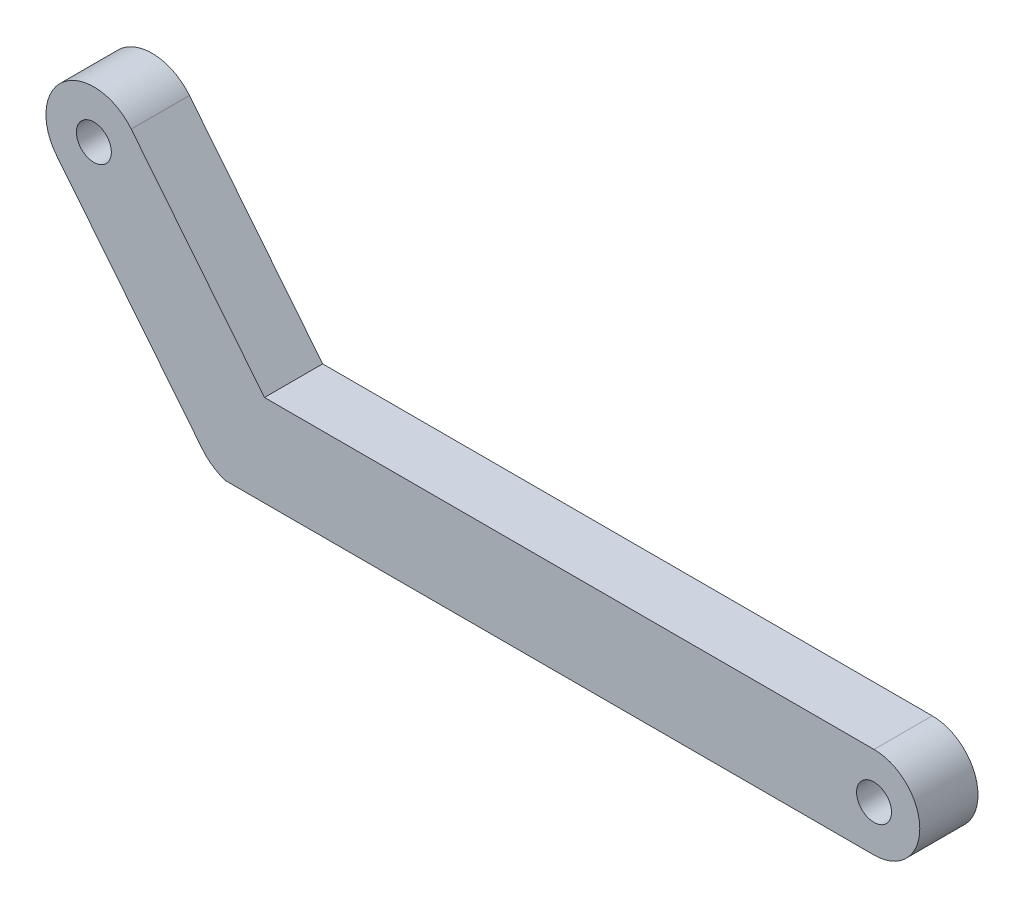
ISO-10303-21;
HEADER;
FILE_DESCRIPTION(('STEP AP214'),'2;1');
FILE_NAME('part.step','',(''),(''),'','','');
FILE_SCHEMA(('AUTOMOTIVE_DESIGN { 1 0 10303 214 1 1 1 1 }'));
ENDSEC;
DATA;
#1=APPLICATION_CONTEXT('core data for automotive mechanical design processes');
#2=APPLICATION_PROTOCOL_DEFINITION('international standard','automotive_design',2000,#1);
#3=PRODUCT_CONTEXT('',#1,'mechanical');
#4=PRODUCT('Part','Part','',(#3));
#5=PRODUCT_RELATED_PRODUCT_CATEGORY('part','',(#4));
#6=PRODUCT_DEFINITION_FORMATION('','',#4);
#7=PRODUCT_DEFINITION_CONTEXT('part definition',#1,'design');
#8=PRODUCT_DEFINITION('design','',#6,#7);
#9=PRODUCT_DEFINITION_SHAPE('','',#8);
#10=(LENGTH_UNIT() NAMED_UNIT(*) SI_UNIT(.MILLI.,.METRE.));
#11=(NAMED_UNIT(*) PLANE_ANGLE_UNIT() SI_UNIT($,.RADIAN.));
#12=(NAMED_UNIT(*) SI_UNIT($,.STERADIAN.) SOLID_ANGLE_UNIT());
#13=UNCERTAINTY_MEASURE_WITH_UNIT(LENGTH_MEASURE(1.E-05),#10,'distance_accuracy_value','');
#14=(GEOMETRIC_REPRESENTATION_CONTEXT(3) GLOBAL_UNCERTAINTY_ASSIGNED_CONTEXT((#13)) GLOBAL_UNIT_ASSIGNED_CONTEXT((#10,
#11,#12)) REPRESENTATION_CONTEXT('',''));
#15=CARTESIAN_POINT('',(0.,0.,0.));
#16=DIRECTION('',(0.,0.,1.));
#17=DIRECTION('',(1.,0.,0.));
#18=AXIS2_PLACEMENT_3D('',#15,#16,#17);
#19=CARTESIAN_POINT('',(3.39642468330183,2.72902053009206,5.));
#20=DIRECTION('',(-0.779536873080404,-0.626356339081858,0.));
#21=DIRECTION('',(0.626356339081858,-0.779536873080404,0.));
#22=AXIS2_PLACEMENT_3D('',#19,#20,#21);
#23=PLANE('',#22);
#24=DIRECTION('',(-0.626356339081858,0.779536873080404,0.));
#25=VECTOR('',#24,1.);
#26=CARTESIAN_POINT('',(3.39642468330183,2.72902053009206,0.));
#27=LINE('',#26,#25);
#28=CARTESIAN_POINT('',(7.66064777969083,-2.57805298583813,0.));
#29=VERTEX_POINT('',#28);
#30=CARTESIAN_POINT('',(-4.86647900194632,13.0126844757699,0.));
#31=VERTEX_POINT('',#30);
#32=EDGE_CURVE('E155',#29,#31,#27,.T.);
#33=ORIENTED_EDGE('',*,*,#32,.F.);
#34=DIRECTION('',(0.,0.,-1.));
#35=VECTOR('',#34,1.);
#36=CARTESIAN_POINT('',(7.66064777969083,-2.57805298583813,5.));
#37=LINE('',#36,#35);
#38=CARTESIAN_POINT('',(7.66064777969083,-2.57805298583813,5.));
#39=VERTEX_POINT('',#38);
#40=EDGE_CURVE('E12',#39,#29,#37,.T.);
#41=ORIENTED_EDGE('',*,*,#40,.F.);
#42=DIRECTION('',(-0.626356339081858,0.779536873080404,0.));
#43=VECTOR('',#42,1.);
#44=CARTESIAN_POINT('',(3.39642468330183,2.72902053009206,5.));
#45=LINE('',#44,#43);
#46=CARTESIAN_POINT('',(-4.86647900194632,13.0126844757699,5.));
#47=VERTEX_POINT('',#46);
#48=EDGE_CURVE('E184',#39,#47,#45,.T.);
#49=ORIENTED_EDGE('',*,*,#48,.T.);
#50=DIRECTION('',(0.,0.,-1.));
#51=VECTOR('',#50,1.);
#52=CARTESIAN_POINT('',(-4.86647900194632,13.0126844757699,5.));
#53=LINE('',#52,#51);
#54=EDGE_CURVE('E90',#47,#31,#53,.T.);
#55=ORIENTED_EDGE('',*,*,#54,.T.);
#56=EDGE_LOOP('',(#33,#41,#49,#55));
#57=FACE_BOUND('',#56,.T.);
#58=ADVANCED_FACE('F42',(#57),#23,.T.);
#59=CARTESIAN_POINT('',(10.8691845786665,0.,5.));
#60=DIRECTION('',(0.,0.,-1.));
#61=DIRECTION('',(-1.,0.,0.));
#62=AXIS2_PLACEMENT_3D('',#59,#60,#61);
#63=CYLINDRICAL_SURFACE('',#62,4.11595257360556);
#64=CARTESIAN_POINT('',(10.8691845786665,0.,0.));
#65=DIRECTION('',(0.,0.,1.));
#66=DIRECTION('',(1.,0.,0.));
#67=AXIS2_PLACEMENT_3D('',#64,#65,#66);
#68=CIRCLE('',#67,4.11595257360556);
#69=CARTESIAN_POINT('',(9.64005519085596,-3.92814288642745,0.));
#70=VERTEX_POINT('',#69);
#71=EDGE_CURVE('E159',#29,#70,#68,.T.);
#72=ORIENTED_EDGE('',*,*,#71,.T.);
#73=DIRECTION('',(0.,0.,-1.));
#74=VECTOR('',#73,1.);
#75=CARTESIAN_POINT('',(9.64005519085596,-3.92814288642745,5.));
#76=LINE('',#75,#74);
#77=CARTESIAN_POINT('',(9.64005519085596,-3.92814288642745,5.));
#78=VERTEX_POINT('',#77);
#79=EDGE_CURVE('E51',#78,#70,#76,.T.);
#80=ORIENTED_EDGE('',*,*,#79,.F.);
#81=CARTESIAN_POINT('',(10.8691845786665,0.,5.));
#82=DIRECTION('',(0.,0.,1.));
#83=DIRECTION('',(1.,0.,0.));
#84=AXIS2_PLACEMENT_3D('',#81,#82,#83);
#85=CIRCLE('',#84,4.11595257360556);
#86=EDGE_CURVE('E227',#39,#78,#85,.T.);
#87=ORIENTED_EDGE('',*,*,#86,.F.);
#88=ORIENTED_EDGE('',*,*,#40,.T.);
#89=EDGE_LOOP('',(#72,#80,#87,#88));
#90=FACE_BOUND('',#89,.T.);
#91=ADVANCED_FACE('F217',(#90),#63,.T.);
#92=CARTESIAN_POINT('',(0.,-3.92814288642745,5.));
#93=DIRECTION('',(0.,1.,0.));
#94=DIRECTION('',(0.,0.,1.));
#95=AXIS2_PLACEMENT_3D('',#92,#93,#94);
#96=PLANE('',#95);
#97=DIRECTION('',(1.,0.,0.));
#98=VECTOR('',#97,1.);
#99=CARTESIAN_POINT('',(0.,-3.92814288642745,0.));
#100=LINE('',#99,#98);
#101=CARTESIAN_POINT('',(65.3420577970294,-3.92814288642745,0.));
#102=VERTEX_POINT('',#101);
#103=EDGE_CURVE('E162',#70,#102,#100,.T.);
#104=ORIENTED_EDGE('',*,*,#103,.T.);
#105=DIRECTION('',(0.,0.,-1.));
#106=VECTOR('',#105,1.);
#107=CARTESIAN_POINT('',(65.3420577970294,-3.92814288642745,5.));
#108=LINE('',#107,#106);
#109=CARTESIAN_POINT('',(65.3420577970294,-3.92814288642745,5.));
#110=VERTEX_POINT('',#109);
#111=EDGE_CURVE('E191',#110,#102,#108,.T.);
#112=ORIENTED_EDGE('',*,*,#111,.F.);
#113=DIRECTION('',(1.,0.,0.));
#114=VECTOR('',#113,1.);
#115=CARTESIAN_POINT('',(0.,-3.92814288642745,5.));
#116=LINE('',#115,#114);
#117=EDGE_CURVE('E131',#78,#110,#116,.T.);
#118=ORIENTED_EDGE('',*,*,#117,.F.);
#119=ORIENTED_EDGE('',*,*,#79,.T.);
#120=EDGE_LOOP('',(#104,#112,#118,#119));
#121=FACE_BOUND('',#120,.T.);
#122=ADVANCED_FACE('F200',(#121),#96,.F.);
#123=CARTESIAN_POINT('',(65.3420577970294,0.,5.));
#124=DIRECTION('',(0.,0.,-1.));
#125=DIRECTION('',(-1.,0.,0.));
#126=AXIS2_PLACEMENT_3D('',#123,#124,#125);
#127=CYLINDRICAL_SURFACE('',#126,3.92814288642745);
#128=CARTESIAN_POINT('',(65.3420577970294,0.,0.));
#129=DIRECTION('',(0.,0.,1.));
#130=DIRECTION('',(1.,0.,0.));
#131=AXIS2_PLACEMENT_3D('',#128,#129,#130);
#132=CIRCLE('',#131,3.92814288642745);
#133=CARTESIAN_POINT('',(65.3420577970294,3.92814288642745,0.));
#134=VERTEX_POINT('',#133);
#135=EDGE_CURVE('E165',#102,#134,#132,.T.);
#136=ORIENTED_EDGE('',*,*,#135,.T.);
#137=DIRECTION('',(0.,0.,-1.));
#138=VECTOR('',#137,1.);
#139=CARTESIAN_POINT('',(65.3420577970294,3.92814288642745,5.));
#140=LINE('',#139,#138);
#141=CARTESIAN_POINT('',(65.3420577970294,3.92814288642745,5.));
#142=VERTEX_POINT('',#141);
#143=EDGE_CURVE('E116',#142,#134,#140,.T.);
#144=ORIENTED_EDGE('',*,*,#143,.F.);
#145=CARTESIAN_POINT('',(65.3420577970294,0.,5.));
#146=DIRECTION('',(0.,0.,1.));
#147=DIRECTION('',(1.,0.,0.));
#148=AXIS2_PLACEMENT_3D('',#145,#146,#147);
#149=CIRCLE('',#148,3.92814288642745);
#150=EDGE_CURVE('E126',#110,#142,#149,.T.);
#151=ORIENTED_EDGE('',*,*,#150,.F.);
#152=ORIENTED_EDGE('',*,*,#111,.T.);
#153=EDGE_LOOP('',(#136,#144,#151,#152));
#154=FACE_BOUND('',#153,.T.);
#155=ADVANCED_FACE('F209',(#154),#127,.T.);
#156=CARTESIAN_POINT('',(0.,3.92814288642745,5.));
#157=DIRECTION('',(0.,1.,0.));
#158=DIRECTION('',(0.,0.,1.));
#159=AXIS2_PLACEMENT_3D('',#156,#157,#158);
#160=PLANE('',#159);
#161=DIRECTION('',(1.,0.,0.));
#162=VECTOR('',#161,1.);
#163=CARTESIAN_POINT('',(0.,3.92814288642745,0.));
#164=LINE('',#163,#162);
#165=CARTESIAN_POINT('',(12.9929268069596,3.92814288642745,0.));
#166=VERTEX_POINT('',#165);
#167=EDGE_CURVE('E114',#166,#134,#164,.T.);
#168=ORIENTED_EDGE('',*,*,#167,.F.);
#169=DIRECTION('',(0.,0.,-1.));
#170=VECTOR('',#169,1.);
#171=CARTESIAN_POINT('',(12.9929268069596,3.92814288642745,5.));
#172=LINE('',#171,#170);
#173=CARTESIAN_POINT('',(12.9929268069596,3.92814288642745,5.));
#174=VERTEX_POINT('',#173);
#175=EDGE_CURVE('E108',#174,#166,#172,.T.);
#176=ORIENTED_EDGE('',*,*,#175,.F.);
#177=DIRECTION('',(1.,0.,0.));
#178=VECTOR('',#177,1.);
#179=CARTESIAN_POINT('',(0.,3.92814288642745,5.));
#180=LINE('',#179,#178);
#181=EDGE_CURVE('E112',#174,#142,#180,.T.);
#182=ORIENTED_EDGE('',*,*,#181,.T.);
#183=ORIENTED_EDGE('',*,*,#143,.T.);
#184=EDGE_LOOP('',(#168,#176,#182,#183));
#185=FACE_BOUND('',#184,.T.);
#186=ADVANCED_FACE('F110',(#185),#160,.T.);
#187=CARTESIAN_POINT('',(9.81349828125327,7.88512650176831,5.));
#188=DIRECTION('',(-0.779536873080404,-0.626356339081857,0.));
#189=DIRECTION('',(0.626356339081857,-0.779536873080404,0.));
#190=AXIS2_PLACEMENT_3D('',#187,#188,#189);
#191=PLANE('',#190);
#192=DIRECTION('',(-0.626356339081857,0.779536873080404,0.));
#193=VECTOR('',#192,1.);
#194=CARTESIAN_POINT('',(9.81349828125327,7.88512650176831,0.));
#195=LINE('',#194,#193);
#196=CARTESIAN_POINT('',(1.55059459600511,18.1687904474462,0.));
#197=VERTEX_POINT('',#196);
#198=EDGE_CURVE('E83',#166,#197,#195,.T.);
#199=ORIENTED_EDGE('',*,*,#198,.T.);
#200=DIRECTION('',(0.,0.,-1.));
#201=VECTOR('',#200,1.);
#202=CARTESIAN_POINT('',(1.55059459600511,18.1687904474462,5.));
#203=LINE('',#202,#201);
#204=CARTESIAN_POINT('',(1.55059459600511,18.1687904474462,5.));
#205=VERTEX_POINT('',#204);
#206=EDGE_CURVE('E117',#205,#197,#203,.T.);
#207=ORIENTED_EDGE('',*,*,#206,.F.);
#208=DIRECTION('',(-0.626356339081857,0.779536873080404,0.));
#209=VECTOR('',#208,1.);
#210=CARTESIAN_POINT('',(9.81349828125327,7.88512650176831,5.));
#211=LINE('',#210,#209);
#212=EDGE_CURVE('E119',#174,#205,#211,.T.);
#213=ORIENTED_EDGE('',*,*,#212,.F.);
#214=ORIENTED_EDGE('',*,*,#175,.T.);
#215=EDGE_LOOP('',(#199,#207,#213,#214));
#216=FACE_BOUND('',#215,.T.);
#217=ADVANCED_FACE('F120',(#216),#191,.F.);
#218=CARTESIAN_POINT('',(-1.65794220297061,15.5907374616081,5.));
#219=DIRECTION('',(0.,0.,-1.));
#220=DIRECTION('',(-1.,0.,0.));
#221=AXIS2_PLACEMENT_3D('',#218,#219,#220);
#222=CYLINDRICAL_SURFACE('',#221,1.5);
#223=CARTESIAN_POINT('',(-1.65794220297061,15.5907374616081,5.));
#224=DIRECTION('',(0.,0.,1.));
#225=DIRECTION('',(1.,0.,0.));
#226=AXIS2_PLACEMENT_3D('',#223,#224,#225);
#227=CIRCLE('',#226,1.5);
#228=CARTESIAN_POINT('',(-0.157942202970606,15.5907374616081,5.));
#229=VERTEX_POINT('',#228);
#230=EDGE_CURVE('E146',#229,#229,#227,.T.);
#231=ORIENTED_EDGE('',*,*,#230,.T.);
#232=EDGE_LOOP('',(#231));
#233=FACE_BOUND('',#232,.T.);
#234=CARTESIAN_POINT('',(-1.65794220297061,15.5907374616081,0.));
#235=DIRECTION('',(0.,0.,1.));
#236=DIRECTION('',(1.,0.,0.));
#237=AXIS2_PLACEMENT_3D('',#234,#235,#236);
#238=CIRCLE('',#237,1.5);
#239=CARTESIAN_POINT('',(-0.157942202970606,15.5907374616081,0.));
#240=VERTEX_POINT('',#239);
#241=EDGE_CURVE('E176',#240,#240,#238,.T.);
#242=ORIENTED_EDGE('',*,*,#241,.F.);
#243=EDGE_LOOP('',(#242));
#244=FACE_BOUND('',#243,.T.);
#245=ADVANCED_FACE('F239',(#233,#244),#222,.F.);
#246=CARTESIAN_POINT('',(-1.65794220297061,15.5907374616081,5.));
#247=DIRECTION('',(0.,0.,-1.));
#248=DIRECTION('',(-1.,0.,0.));
#249=AXIS2_PLACEMENT_3D('',#246,#247,#248);
#250=CYLINDRICAL_SURFACE('',#249,4.11595257360556);
#251=CARTESIAN_POINT('',(-1.65794220297061,15.5907374616081,0.));
#252=DIRECTION('',(0.,0.,1.));
#253=DIRECTION('',(1.,0.,0.));
#254=AXIS2_PLACEMENT_3D('',#251,#252,#253);
#255=CIRCLE('',#254,4.11595257360556);
#256=EDGE_CURVE('E173',#197,#31,#255,.T.);
#257=ORIENTED_EDGE('',*,*,#256,.T.);
#258=ORIENTED_EDGE('',*,*,#54,.F.);
#259=CARTESIAN_POINT('',(-1.65794220297061,15.5907374616081,5.));
#260=DIRECTION('',(0.,0.,1.));
#261=DIRECTION('',(1.,0.,0.));
#262=AXIS2_PLACEMENT_3D('',#259,#260,#261);
#263=CIRCLE('',#262,4.11595257360556);
#264=EDGE_CURVE('E59',#205,#47,#263,.T.);
#265=ORIENTED_EDGE('',*,*,#264,.F.);
#266=ORIENTED_EDGE('',*,*,#206,.T.);
#267=EDGE_LOOP('',(#257,#258,#265,#266));
#268=FACE_BOUND('',#267,.T.);
#269=ADVANCED_FACE('F225',(#268),#250,.T.);
#270=CARTESIAN_POINT('',(65.3420577970294,0.,5.));
#271=DIRECTION('',(0.,0.,-1.));
#272=DIRECTION('',(-1.,0.,0.));
#273=AXIS2_PLACEMENT_3D('',#270,#271,#272);
#274=CYLINDRICAL_SURFACE('',#273,1.5);
#275=CARTESIAN_POINT('',(65.3420577970294,0.,5.));
#276=DIRECTION('',(0.,0.,1.));
#277=DIRECTION('',(1.,0.,0.));
#278=AXIS2_PLACEMENT_3D('',#275,#276,#277);
#279=CIRCLE('',#278,1.5);
#280=CARTESIAN_POINT('',(66.8420577970294,0.,5.));
#281=VERTEX_POINT('',#280);
#282=EDGE_CURVE('E150',#281,#281,#279,.T.);
#283=ORIENTED_EDGE('',*,*,#282,.T.);
#284=EDGE_LOOP('',(#283));
#285=FACE_BOUND('',#284,.T.);
#286=CARTESIAN_POINT('',(65.3420577970294,0.,0.));
#287=DIRECTION('',(0.,0.,1.));
#288=DIRECTION('',(1.,0.,0.));
#289=AXIS2_PLACEMENT_3D('',#286,#287,#288);
#290=CIRCLE('',#289,1.5);
#291=CARTESIAN_POINT('',(66.8420577970294,0.,0.));
#292=VERTEX_POINT('',#291);
#293=EDGE_CURVE('E180',#292,#292,#290,.T.);
#294=ORIENTED_EDGE('',*,*,#293,.F.);
#295=EDGE_LOOP('',(#294));
#296=FACE_BOUND('',#295,.T.);
#297=ADVANCED_FACE('F238',(#285,#296),#274,.F.);
#298=CARTESIAN_POINT('',(0.,0.,5.));
#299=DIRECTION('',(0.,0.,1.));
#300=DIRECTION('',(1.,0.,0.));
#301=AXIS2_PLACEMENT_3D('',#298,#299,#300);
#302=PLANE('',#301);
#303=ORIENTED_EDGE('',*,*,#48,.F.);
#304=ORIENTED_EDGE('',*,*,#86,.T.);
#305=ORIENTED_EDGE('',*,*,#117,.T.);
#306=ORIENTED_EDGE('',*,*,#150,.T.);
#307=ORIENTED_EDGE('',*,*,#181,.F.);
#308=ORIENTED_EDGE('',*,*,#212,.T.);
#309=ORIENTED_EDGE('',*,*,#264,.T.);
#310=EDGE_LOOP('',(#303,#304,#305,#306,#307,#308,#309));
#311=FACE_BOUND('',#310,.T.);
#312=ORIENTED_EDGE('',*,*,#230,.F.);
#313=EDGE_LOOP('',(#312));
#314=FACE_BOUND('',#313,.T.);
#315=ORIENTED_EDGE('',*,*,#282,.F.);
#316=EDGE_LOOP('',(#315));
#317=FACE_BOUND('',#316,.T.);
#318=ADVANCED_FACE('F123',(#311,#314,#317),#302,.T.);
#319=CARTESIAN_POINT('',(0.,0.,0.));
#320=DIRECTION('',(0.,0.,1.));
#321=DIRECTION('',(1.,0.,0.));
#322=AXIS2_PLACEMENT_3D('',#319,#320,#321);
#323=PLANE('',#322);
#324=ORIENTED_EDGE('',*,*,#32,.T.);
#325=ORIENTED_EDGE('',*,*,#256,.F.);
#326=ORIENTED_EDGE('',*,*,#198,.F.);
#327=ORIENTED_EDGE('',*,*,#167,.T.);
#328=ORIENTED_EDGE('',*,*,#135,.F.);
#329=ORIENTED_EDGE('',*,*,#103,.F.);
#330=ORIENTED_EDGE('',*,*,#71,.F.);
#331=EDGE_LOOP('',(#324,#325,#326,#327,#328,#329,#330));
#332=FACE_BOUND('',#331,.T.);
#333=ORIENTED_EDGE('',*,*,#241,.T.);
#334=EDGE_LOOP('',(#333));
#335=FACE_BOUND('',#334,.T.);
#336=ORIENTED_EDGE('',*,*,#293,.T.);
#337=EDGE_LOOP('',(#336));
#338=FACE_BOUND('',#337,.T.);
#339=ADVANCED_FACE('F206',(#332,#335,#338),#323,.F.);
#340=CLOSED_SHELL('',(#58,#91,#122,#155,#186,#217,#245,#269,#297,#318,#339));
#341=MANIFOLD_SOLID_BREP('B2',#340);
#342=ADVANCED_BREP_SHAPE_REPRESENTATION('',(#18,#341),#14);
#343=SHAPE_DEFINITION_REPRESENTATION(#9,#342);
ENDSEC;
END-ISO-10303-21;
